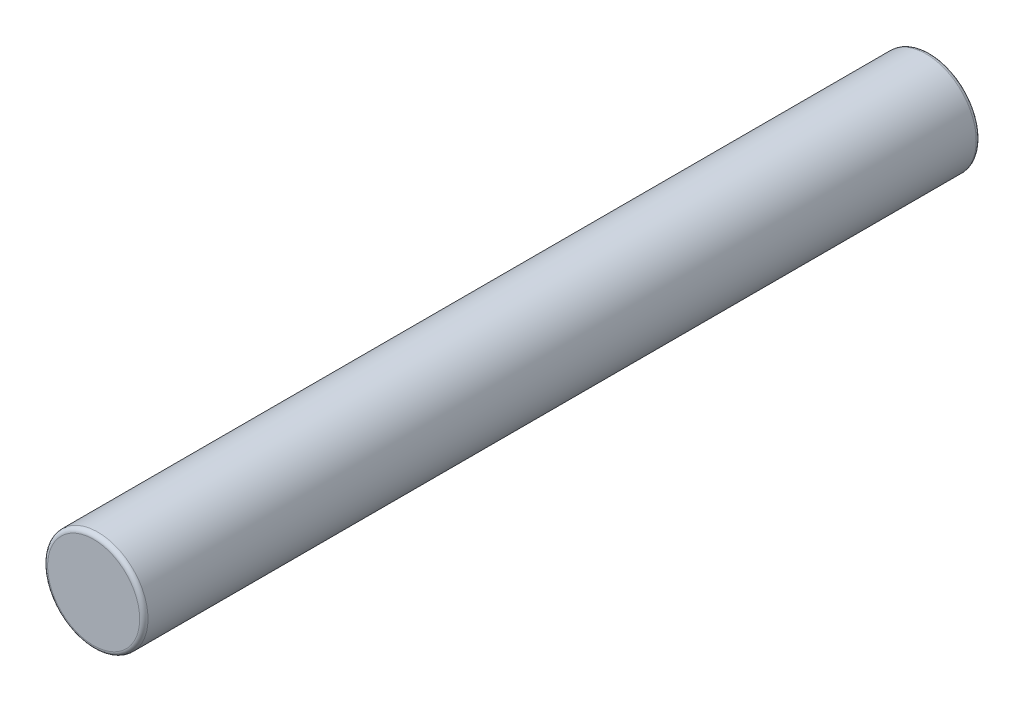
ISO-10303-21;
HEADER;
FILE_DESCRIPTION(('STEP AP214'),'2;1');
FILE_NAME('part.step','',(''),(''),'','','');
FILE_SCHEMA(('AUTOMOTIVE_DESIGN { 1 0 10303 214 1 1 1 1 }'));
ENDSEC;
DATA;
#1=APPLICATION_CONTEXT('core data for automotive mechanical design processes');
#2=APPLICATION_PROTOCOL_DEFINITION('international standard','automotive_design',2000,#1);
#3=PRODUCT_CONTEXT('',#1,'mechanical');
#4=PRODUCT('Part','Part','',(#3));
#5=PRODUCT_RELATED_PRODUCT_CATEGORY('part','',(#4));
#6=PRODUCT_DEFINITION_FORMATION('','',#4);
#7=PRODUCT_DEFINITION_CONTEXT('part definition',#1,'design');
#8=PRODUCT_DEFINITION('design','',#6,#7);
#9=PRODUCT_DEFINITION_SHAPE('','',#8);
#10=(LENGTH_UNIT() NAMED_UNIT(*) SI_UNIT(.MILLI.,.METRE.));
#11=(NAMED_UNIT(*) PLANE_ANGLE_UNIT() SI_UNIT($,.RADIAN.));
#12=(NAMED_UNIT(*) SI_UNIT($,.STERADIAN.) SOLID_ANGLE_UNIT());
#13=UNCERTAINTY_MEASURE_WITH_UNIT(LENGTH_MEASURE(1.E-05),#10,'distance_accuracy_value','');
#14=(GEOMETRIC_REPRESENTATION_CONTEXT(3) GLOBAL_UNCERTAINTY_ASSIGNED_CONTEXT((#13)) GLOBAL_UNIT_ASSIGNED_CONTEXT((#10,
#11,#12)) REPRESENTATION_CONTEXT('',''));
#15=CARTESIAN_POINT('',(0.,0.,0.));
#16=DIRECTION('',(0.,0.,1.));
#17=DIRECTION('',(1.,0.,0.));
#18=AXIS2_PLACEMENT_3D('',#15,#16,#17);
#19=CARTESIAN_POINT('',(0.,-1.38777878078145E-13,-50.0000000000001));
#20=DIRECTION('',(0.,0.,1.00000000000001));
#21=DIRECTION('',(1.,0.,0.));
#22=AXIS2_PLACEMENT_3D('',#19,#20,#21);
#23=CYLINDRICAL_SURFACE('',#22,3.);
#24=CARTESIAN_POINT('',(0.,-1.38777878078145E-13,-49.7500000000001));
#25=DIRECTION('',(0.,0.,1.00000000000001));
#26=DIRECTION('',(1.,0.,0.));
#27=AXIS2_PLACEMENT_3D('',#24,#25,#26);
#28=CIRCLE('',#27,3.);
#29=CARTESIAN_POINT('',(2.99999999999994,-1.38777878078145E-13,-49.7500000000001));
#30=VERTEX_POINT('',#29);
#31=EDGE_CURVE('E73',#30,#30,#28,.T.);
#32=ORIENTED_EDGE('',*,*,#31,.T.);
#33=EDGE_LOOP('',(#32));
#34=FACE_BOUND('',#33,.T.);
#35=CARTESIAN_POINT('',(0.,-1.38777878078145E-13,-0.250000000000028));
#36=DIRECTION('',(0.,0.,1.00000000000001));
#37=DIRECTION('',(1.,0.,0.));
#38=AXIS2_PLACEMENT_3D('',#35,#36,#37);
#39=CIRCLE('',#38,3.);
#40=CARTESIAN_POINT('',(2.99999999999994,-1.38777878078145E-13,-0.250000000000028));
#41=VERTEX_POINT('',#40);
#42=EDGE_CURVE('E79',#41,#41,#39,.F.);
#43=ORIENTED_EDGE('',*,*,#42,.T.);
#44=EDGE_LOOP('',(#43));
#45=FACE_BOUND('',#44,.T.);
#46=ADVANCED_FACE('F59',(#34,#45),#23,.T.);
#47=CARTESIAN_POINT('',(0.,-1.38777878078145E-13,-50.0000000000001));
#48=DIRECTION('',(0.,0.,1.00000000000001));
#49=DIRECTION('',(1.,0.,0.));
#50=AXIS2_PLACEMENT_3D('',#47,#48,#49);
#51=PLANE('',#50);
#52=CARTESIAN_POINT('',(0.,-1.38777878078145E-13,-50.0000000000001));
#53=DIRECTION('',(0.,0.,1.00000000000001));
#54=DIRECTION('',(1.,0.,0.));
#55=AXIS2_PLACEMENT_3D('',#52,#53,#54);
#56=CIRCLE('',#55,2.75);
#57=CARTESIAN_POINT('',(2.74999999999995,-1.38777878078145E-13,-50.0000000000001));
#58=VERTEX_POINT('',#57);
#59=EDGE_CURVE('E67',#58,#58,#56,.F.);
#60=ORIENTED_EDGE('',*,*,#59,.T.);
#61=EDGE_LOOP('',(#60));
#62=FACE_BOUND('',#61,.T.);
#63=ADVANCED_FACE('F98',(#62),#51,.F.);
#64=CARTESIAN_POINT('',(0.,0.,0.));
#65=DIRECTION('',(0.,0.,1.00000000000001));
#66=DIRECTION('',(1.,0.,0.));
#67=AXIS2_PLACEMENT_3D('',#64,#65,#66);
#68=PLANE('',#67);
#69=CARTESIAN_POINT('',(0.,0.,0.));
#70=DIRECTION('',(0.,0.,1.00000000000001));
#71=DIRECTION('',(1.,0.,0.));
#72=AXIS2_PLACEMENT_3D('',#69,#70,#71);
#73=CIRCLE('',#72,2.75);
#74=CARTESIAN_POINT('',(2.75,0.,0.));
#75=VERTEX_POINT('',#74);
#76=EDGE_CURVE('E12',#75,#75,#73,.T.);
#77=ORIENTED_EDGE('',*,*,#76,.T.);
#78=EDGE_LOOP('',(#77));
#79=FACE_BOUND('',#78,.T.);
#80=ADVANCED_FACE('F95',(#79),#68,.T.);
#81=CARTESIAN_POINT('',(0.,-1.38777878078145E-13,-49.7500000000001));
#82=DIRECTION('',(0.,0.,1.00000000000001));
#83=DIRECTION('',(1.,0.,0.));
#84=AXIS2_PLACEMENT_3D('',#81,#82,#83);
#85=TOROIDAL_SURFACE('',#84,2.75,0.25);
#86=ORIENTED_EDGE('',*,*,#59,.F.);
#87=EDGE_LOOP('',(#86));
#88=FACE_BOUND('',#87,.T.);
#89=ORIENTED_EDGE('',*,*,#31,.F.);
#90=EDGE_LOOP('',(#89));
#91=FACE_BOUND('',#90,.T.);
#92=ADVANCED_FACE('F90',(#88,#91),#85,.T.);
#93=CARTESIAN_POINT('',(0.,-1.38777878078145E-13,-0.250000000000028));
#94=DIRECTION('',(0.,0.,1.00000000000001));
#95=DIRECTION('',(1.,0.,0.));
#96=AXIS2_PLACEMENT_3D('',#93,#94,#95);
#97=TOROIDAL_SURFACE('',#96,2.75,0.25);
#98=ORIENTED_EDGE('',*,*,#42,.F.);
#99=EDGE_LOOP('',(#98));
#100=FACE_BOUND('',#99,.T.);
#101=ORIENTED_EDGE('',*,*,#76,.F.);
#102=EDGE_LOOP('',(#101));
#103=FACE_BOUND('',#102,.T.);
#104=ADVANCED_FACE('F61',(#100,#103),#97,.T.);
#105=CLOSED_SHELL('',(#46,#63,#80,#92,#104));
#106=MANIFOLD_SOLID_BREP('B2',#105);
#107=ADVANCED_BREP_SHAPE_REPRESENTATION('',(#18,#106),#14);
#108=SHAPE_DEFINITION_REPRESENTATION(#9,#107);
ENDSEC;
END-ISO-10303-21;
